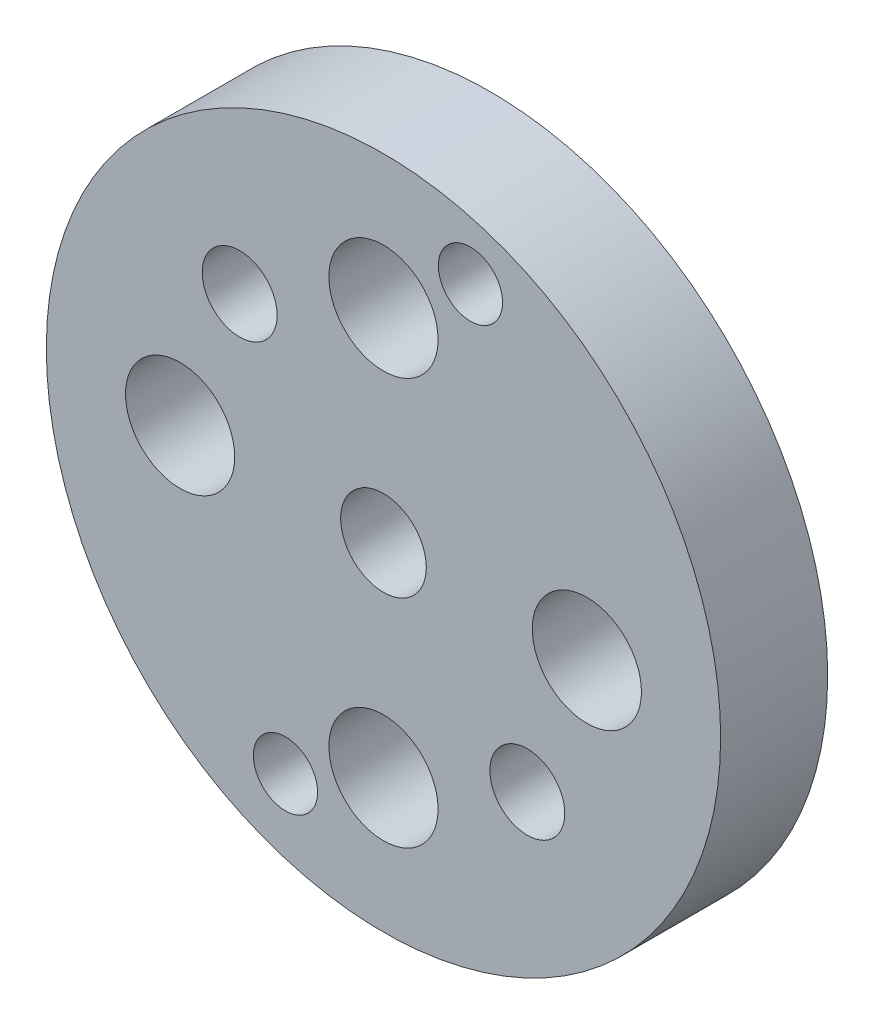
ISO-10303-21;
HEADER;
FILE_DESCRIPTION(('STEP AP214'),'2;1');
FILE_NAME('part.step','',(''),(''),'','','');
FILE_SCHEMA(('AUTOMOTIVE_DESIGN { 1 0 10303 214 1 1 1 1 }'));
ENDSEC;
DATA;
#1=APPLICATION_CONTEXT('core data for automotive mechanical design processes');
#2=APPLICATION_PROTOCOL_DEFINITION('international standard','automotive_design',2000,#1);
#3=PRODUCT_CONTEXT('',#1,'mechanical');
#4=PRODUCT('Part','Part','',(#3));
#5=PRODUCT_RELATED_PRODUCT_CATEGORY('part','',(#4));
#6=PRODUCT_DEFINITION_FORMATION('','',#4);
#7=PRODUCT_DEFINITION_CONTEXT('part definition',#1,'design');
#8=PRODUCT_DEFINITION('design','',#6,#7);
#9=PRODUCT_DEFINITION_SHAPE('','',#8);
#10=(LENGTH_UNIT() NAMED_UNIT(*) SI_UNIT(.MILLI.,.METRE.));
#11=(NAMED_UNIT(*) PLANE_ANGLE_UNIT() SI_UNIT($,.RADIAN.));
#12=(NAMED_UNIT(*) SI_UNIT($,.STERADIAN.) SOLID_ANGLE_UNIT());
#13=UNCERTAINTY_MEASURE_WITH_UNIT(LENGTH_MEASURE(1.E-05),#10,'distance_accuracy_value','');
#14=(GEOMETRIC_REPRESENTATION_CONTEXT(3) GLOBAL_UNCERTAINTY_ASSIGNED_CONTEXT((#13)) GLOBAL_UNIT_ASSIGNED_CONTEXT((#10,
#11,#12)) REPRESENTATION_CONTEXT('',''));
#15=CARTESIAN_POINT('',(0.,0.,0.));
#16=DIRECTION('',(0.,0.,1.));
#17=DIRECTION('',(1.,0.,0.));
#18=AXIS2_PLACEMENT_3D('',#15,#16,#17);
#19=CARTESIAN_POINT('',(19.,0.,10.));
#20=DIRECTION('',(0.,0.,-1.));
#21=DIRECTION('',(-1.,0.,0.));
#22=AXIS2_PLACEMENT_3D('',#19,#20,#21);
#23=CYLINDRICAL_SURFACE('',#22,5.1);
#24=CARTESIAN_POINT('',(19.,0.,2.));
#25=DIRECTION('',(0.,0.,1.));
#26=DIRECTION('',(1.,0.,0.));
#27=AXIS2_PLACEMENT_3D('',#24,#25,#26);
#28=CIRCLE('',#27,5.1);
#29=CARTESIAN_POINT('',(24.1,0.,2.));
#30=VERTEX_POINT('',#29);
#31=EDGE_CURVE('E152',#30,#30,#28,.F.);
#32=ORIENTED_EDGE('',*,*,#31,.T.);
#33=EDGE_LOOP('',(#32));
#34=FACE_BOUND('',#33,.T.);
#35=CARTESIAN_POINT('',(19.,0.,10.));
#36=DIRECTION('',(0.,0.,1.));
#37=DIRECTION('',(1.,0.,0.));
#38=AXIS2_PLACEMENT_3D('',#35,#36,#37);
#39=CIRCLE('',#38,5.1);
#40=CARTESIAN_POINT('',(24.1,0.,10.));
#41=VERTEX_POINT('',#40);
#42=EDGE_CURVE('E81',#41,#41,#39,.F.);
#43=ORIENTED_EDGE('',*,*,#42,.F.);
#44=EDGE_LOOP('',(#43));
#45=FACE_BOUND('',#44,.T.);
#46=ADVANCED_FACE('F39',(#34,#45),#23,.F.);
#47=CARTESIAN_POINT('',(0.,0.,10.));
#48=DIRECTION('',(0.,0.,-1.));
#49=DIRECTION('',(-1.,0.,0.));
#50=AXIS2_PLACEMENT_3D('',#47,#48,#49);
#51=CYLINDRICAL_SURFACE('',#50,31.5);
#52=CARTESIAN_POINT('',(0.,0.,10.));
#53=DIRECTION('',(0.,0.,1.));
#54=DIRECTION('',(1.,0.,0.));
#55=AXIS2_PLACEMENT_3D('',#52,#53,#54);
#56=CIRCLE('',#55,31.5);
#57=CARTESIAN_POINT('',(31.5,0.,10.));
#58=VERTEX_POINT('',#57);
#59=EDGE_CURVE('E85',#58,#58,#56,.T.);
#60=ORIENTED_EDGE('',*,*,#59,.F.);
#61=EDGE_LOOP('',(#60));
#62=FACE_BOUND('',#61,.T.);
#63=CARTESIAN_POINT('',(0.,0.,0.));
#64=DIRECTION('',(0.,0.,1.));
#65=DIRECTION('',(1.,0.,0.));
#66=AXIS2_PLACEMENT_3D('',#63,#64,#65);
#67=CIRCLE('',#66,31.5);
#68=CARTESIAN_POINT('',(31.5,0.,0.));
#69=VERTEX_POINT('',#68);
#70=EDGE_CURVE('E73',#69,#69,#67,.T.);
#71=ORIENTED_EDGE('',*,*,#70,.T.);
#72=EDGE_LOOP('',(#71));
#73=FACE_BOUND('',#72,.T.);
#74=ADVANCED_FACE('F204',(#62,#73),#51,.T.);
#75=CARTESIAN_POINT('',(8.12465383877984,25.,10.));
#76=DIRECTION('',(0.,0.,-1.));
#77=DIRECTION('',(-1.,0.,0.));
#78=AXIS2_PLACEMENT_3D('',#75,#76,#77);
#79=CYLINDRICAL_SURFACE('',#78,3.);
#80=CARTESIAN_POINT('',(8.12465383877984,25.,2.));
#81=DIRECTION('',(0.,0.,1.));
#82=DIRECTION('',(1.,0.,0.));
#83=AXIS2_PLACEMENT_3D('',#80,#81,#82);
#84=CIRCLE('',#83,3.);
#85=CARTESIAN_POINT('',(11.1246538387798,25.,2.));
#86=VERTEX_POINT('',#85);
#87=EDGE_CURVE('E47',#86,#86,#84,.T.);
#88=ORIENTED_EDGE('',*,*,#87,.F.);
#89=EDGE_LOOP('',(#88));
#90=FACE_BOUND('',#89,.T.);
#91=CARTESIAN_POINT('',(8.12465383877984,25.,10.));
#92=DIRECTION('',(0.,0.,1.));
#93=DIRECTION('',(1.,0.,0.));
#94=AXIS2_PLACEMENT_3D('',#91,#92,#93);
#95=CIRCLE('',#94,3.);
#96=CARTESIAN_POINT('',(11.1246538387798,25.,10.));
#97=VERTEX_POINT('',#96);
#98=EDGE_CURVE('E89',#97,#97,#95,.T.);
#99=ORIENTED_EDGE('',*,*,#98,.T.);
#100=EDGE_LOOP('',(#99));
#101=FACE_BOUND('',#100,.T.);
#102=ADVANCED_FACE('F210',(#90,#101),#79,.F.);
#103=CARTESIAN_POINT('',(-9.15629447225261,-23.2628947368421,10.));
#104=DIRECTION('',(0.,0.,-1.));
#105=DIRECTION('',(-1.,0.,0.));
#106=AXIS2_PLACEMENT_3D('',#103,#104,#105);
#107=CYLINDRICAL_SURFACE('',#106,3.00000901800442);
#108=CARTESIAN_POINT('',(-9.15629447225261,-23.2628947368421,2.));
#109=DIRECTION('',(0.,0.,1.));
#110=DIRECTION('',(1.,0.,0.));
#111=AXIS2_PLACEMENT_3D('',#108,#109,#110);
#112=CIRCLE('',#111,3.00000901800442);
#113=CARTESIAN_POINT('',(-6.1562854542482,-23.2628947368421,2.));
#114=VERTEX_POINT('',#113);
#115=EDGE_CURVE('E10',#114,#114,#112,.T.);
#116=ORIENTED_EDGE('',*,*,#115,.F.);
#117=EDGE_LOOP('',(#116));
#118=FACE_BOUND('',#117,.T.);
#119=CARTESIAN_POINT('',(-9.15629447225261,-23.2628947368421,10.));
#120=DIRECTION('',(0.,0.,1.));
#121=DIRECTION('',(1.,0.,0.));
#122=AXIS2_PLACEMENT_3D('',#119,#120,#121);
#123=CIRCLE('',#122,3.00000901800442);
#124=CARTESIAN_POINT('',(-6.1562854542482,-23.2628947368421,10.));
#125=VERTEX_POINT('',#124);
#126=EDGE_CURVE('E93',#125,#125,#123,.T.);
#127=ORIENTED_EDGE('',*,*,#126,.T.);
#128=EDGE_LOOP('',(#127));
#129=FACE_BOUND('',#128,.T.);
#130=ADVANCED_FACE('F220',(#118,#129),#107,.F.);
#131=CARTESIAN_POINT('',(0.,19.,10.));
#132=DIRECTION('',(0.,0.,-1.));
#133=DIRECTION('',(-1.,0.,0.));
#134=AXIS2_PLACEMENT_3D('',#131,#132,#133);
#135=CYLINDRICAL_SURFACE('',#134,5.1);
#136=CARTESIAN_POINT('',(0.,19.,2.));
#137=DIRECTION('',(0.,0.,1.));
#138=DIRECTION('',(1.,0.,0.));
#139=AXIS2_PLACEMENT_3D('',#136,#137,#138);
#140=CIRCLE('',#139,5.1);
#141=CARTESIAN_POINT('',(5.1,19.,2.));
#142=VERTEX_POINT('',#141);
#143=EDGE_CURVE('E52',#142,#142,#140,.T.);
#144=ORIENTED_EDGE('',*,*,#143,.F.);
#145=EDGE_LOOP('',(#144));
#146=FACE_BOUND('',#145,.T.);
#147=CARTESIAN_POINT('',(0.,19.,10.));
#148=DIRECTION('',(0.,0.,1.));
#149=DIRECTION('',(1.,0.,0.));
#150=AXIS2_PLACEMENT_3D('',#147,#148,#149);
#151=CIRCLE('',#150,5.1);
#152=CARTESIAN_POINT('',(5.1,19.,10.));
#153=VERTEX_POINT('',#152);
#154=EDGE_CURVE('E97',#153,#153,#151,.T.);
#155=ORIENTED_EDGE('',*,*,#154,.T.);
#156=EDGE_LOOP('',(#155));
#157=FACE_BOUND('',#156,.T.);
#158=ADVANCED_FACE('F224',(#146,#157),#135,.F.);
#159=CARTESIAN_POINT('',(-13.4365368421053,13.4335206737008,10.));
#160=DIRECTION('',(0.,0.,-1.));
#161=DIRECTION('',(-1.,0.,0.));
#162=AXIS2_PLACEMENT_3D('',#159,#160,#161);
#163=CYLINDRICAL_SURFACE('',#162,3.5);
#164=CARTESIAN_POINT('',(-13.4365368421053,13.4335206737008,2.));
#165=DIRECTION('',(0.,0.,1.));
#166=DIRECTION('',(1.,0.,0.));
#167=AXIS2_PLACEMENT_3D('',#164,#165,#166);
#168=CIRCLE('',#167,3.5);
#169=CARTESIAN_POINT('',(-9.93653684210526,13.4335206737008,2.));
#170=VERTEX_POINT('',#169);
#171=EDGE_CURVE('E57',#170,#170,#168,.T.);
#172=ORIENTED_EDGE('',*,*,#171,.F.);
#173=EDGE_LOOP('',(#172));
#174=FACE_BOUND('',#173,.T.);
#175=CARTESIAN_POINT('',(-13.4365368421053,13.4335206737008,10.));
#176=DIRECTION('',(0.,0.,1.));
#177=DIRECTION('',(1.,0.,0.));
#178=AXIS2_PLACEMENT_3D('',#175,#176,#177);
#179=CIRCLE('',#178,3.5);
#180=CARTESIAN_POINT('',(-9.93653684210526,13.4335206737008,10.));
#181=VERTEX_POINT('',#180);
#182=EDGE_CURVE('E101',#181,#181,#179,.T.);
#183=ORIENTED_EDGE('',*,*,#182,.T.);
#184=EDGE_LOOP('',(#183));
#185=FACE_BOUND('',#184,.T.);
#186=ADVANCED_FACE('F228',(#174,#185),#163,.F.);
#187=CARTESIAN_POINT('',(-19.,0.,10.));
#188=DIRECTION('',(0.,0.,-1.));
#189=DIRECTION('',(-1.,0.,0.));
#190=AXIS2_PLACEMENT_3D('',#187,#188,#189);
#191=CYLINDRICAL_SURFACE('',#190,5.1);
#192=CARTESIAN_POINT('',(-19.,0.,2.));
#193=DIRECTION('',(0.,0.,1.));
#194=DIRECTION('',(1.,0.,0.));
#195=AXIS2_PLACEMENT_3D('',#192,#193,#194);
#196=CIRCLE('',#195,5.1);
#197=CARTESIAN_POINT('',(-13.9,0.,2.));
#198=VERTEX_POINT('',#197);
#199=EDGE_CURVE('E63',#198,#198,#196,.T.);
#200=ORIENTED_EDGE('',*,*,#199,.F.);
#201=EDGE_LOOP('',(#200));
#202=FACE_BOUND('',#201,.T.);
#203=CARTESIAN_POINT('',(-19.,0.,10.));
#204=DIRECTION('',(0.,0.,1.));
#205=DIRECTION('',(1.,0.,0.));
#206=AXIS2_PLACEMENT_3D('',#203,#204,#205);
#207=CIRCLE('',#206,5.1);
#208=CARTESIAN_POINT('',(-13.9,0.,10.));
#209=VERTEX_POINT('',#208);
#210=EDGE_CURVE('E105',#209,#209,#207,.T.);
#211=ORIENTED_EDGE('',*,*,#210,.T.);
#212=EDGE_LOOP('',(#211));
#213=FACE_BOUND('',#212,.T.);
#214=ADVANCED_FACE('F232',(#202,#213),#191,.F.);
#215=CARTESIAN_POINT('',(0.,-19.,10.));
#216=DIRECTION('',(0.,0.,-1.));
#217=DIRECTION('',(-1.,0.,0.));
#218=AXIS2_PLACEMENT_3D('',#215,#216,#217);
#219=CYLINDRICAL_SURFACE('',#218,5.1);
#220=CARTESIAN_POINT('',(0.,-19.,2.));
#221=DIRECTION('',(0.,0.,1.));
#222=DIRECTION('',(1.,0.,0.));
#223=AXIS2_PLACEMENT_3D('',#220,#221,#222);
#224=CIRCLE('',#223,5.1);
#225=CARTESIAN_POINT('',(5.1,-19.,2.));
#226=VERTEX_POINT('',#225);
#227=EDGE_CURVE('E176',#226,#226,#224,.F.);
#228=ORIENTED_EDGE('',*,*,#227,.T.);
#229=EDGE_LOOP('',(#228));
#230=FACE_BOUND('',#229,.T.);
#231=CARTESIAN_POINT('',(0.,-19.,10.));
#232=DIRECTION('',(0.,0.,1.));
#233=DIRECTION('',(1.,0.,0.));
#234=AXIS2_PLACEMENT_3D('',#231,#232,#233);
#235=CIRCLE('',#234,5.1);
#236=CARTESIAN_POINT('',(5.1,-19.,10.));
#237=VERTEX_POINT('',#236);
#238=EDGE_CURVE('E109',#237,#237,#235,.F.);
#239=ORIENTED_EDGE('',*,*,#238,.F.);
#240=EDGE_LOOP('',(#239));
#241=FACE_BOUND('',#240,.T.);
#242=ADVANCED_FACE('F235',(#230,#241),#219,.F.);
#243=CARTESIAN_POINT('',(13.4365368421053,-13.4335206737008,10.));
#244=DIRECTION('',(0.,0.,-1.));
#245=DIRECTION('',(-1.,0.,0.));
#246=AXIS2_PLACEMENT_3D('',#243,#244,#245);
#247=CYLINDRICAL_SURFACE('',#246,3.5);
#248=CARTESIAN_POINT('',(13.4365368421053,-13.4335206737008,2.));
#249=DIRECTION('',(0.,0.,1.));
#250=DIRECTION('',(1.,0.,0.));
#251=AXIS2_PLACEMENT_3D('',#248,#249,#250);
#252=CIRCLE('',#251,3.5);
#253=CARTESIAN_POINT('',(16.9365368421053,-13.4335206737008,2.));
#254=VERTEX_POINT('',#253);
#255=EDGE_CURVE('E153',#254,#254,#252,.F.);
#256=ORIENTED_EDGE('',*,*,#255,.T.);
#257=EDGE_LOOP('',(#256));
#258=FACE_BOUND('',#257,.T.);
#259=CARTESIAN_POINT('',(13.4365368421053,-13.4335206737008,10.));
#260=DIRECTION('',(0.,0.,1.));
#261=DIRECTION('',(1.,0.,0.));
#262=AXIS2_PLACEMENT_3D('',#259,#260,#261);
#263=CIRCLE('',#262,3.5);
#264=CARTESIAN_POINT('',(16.9365368421053,-13.4335206737008,10.));
#265=VERTEX_POINT('',#264);
#266=EDGE_CURVE('E72',#265,#265,#263,.F.);
#267=ORIENTED_EDGE('',*,*,#266,.F.);
#268=EDGE_LOOP('',(#267));
#269=FACE_BOUND('',#268,.T.);
#270=ADVANCED_FACE('F41',(#258,#269),#247,.F.);
#271=CARTESIAN_POINT('',(0.,0.,10.));
#272=DIRECTION('',(0.,0.,-1.));
#273=DIRECTION('',(-1.,0.,0.));
#274=AXIS2_PLACEMENT_3D('',#271,#272,#273);
#275=CYLINDRICAL_SURFACE('',#274,4.);
#276=CARTESIAN_POINT('',(0.,0.,10.));
#277=DIRECTION('',(0.,0.,1.));
#278=DIRECTION('',(1.,0.,0.));
#279=AXIS2_PLACEMENT_3D('',#276,#277,#278);
#280=CIRCLE('',#279,4.);
#281=CARTESIAN_POINT('',(4.,0.,10.));
#282=VERTEX_POINT('',#281);
#283=EDGE_CURVE('E67',#282,#282,#280,.T.);
#284=ORIENTED_EDGE('',*,*,#283,.T.);
#285=EDGE_LOOP('',(#284));
#286=FACE_BOUND('',#285,.T.);
#287=CARTESIAN_POINT('',(0.,0.,0.));
#288=DIRECTION('',(0.,0.,1.));
#289=DIRECTION('',(1.,0.,0.));
#290=AXIS2_PLACEMENT_3D('',#287,#288,#289);
#291=CIRCLE('',#290,4.);
#292=CARTESIAN_POINT('',(4.,0.,0.));
#293=VERTEX_POINT('',#292);
#294=EDGE_CURVE('E68',#293,#293,#291,.T.);
#295=ORIENTED_EDGE('',*,*,#294,.F.);
#296=EDGE_LOOP('',(#295));
#297=FACE_BOUND('',#296,.T.);
#298=ADVANCED_FACE('F215',(#286,#297),#275,.F.);
#299=CARTESIAN_POINT('',(0.,0.,10.));
#300=DIRECTION('',(0.,0.,1.));
#301=DIRECTION('',(1.,0.,0.));
#302=AXIS2_PLACEMENT_3D('',#299,#300,#301);
#303=PLANE('',#302);
#304=ORIENTED_EDGE('',*,*,#266,.T.);
#305=EDGE_LOOP('',(#304));
#306=FACE_BOUND('',#305,.T.);
#307=ORIENTED_EDGE('',*,*,#238,.T.);
#308=EDGE_LOOP('',(#307));
#309=FACE_BOUND('',#308,.T.);
#310=ORIENTED_EDGE('',*,*,#210,.F.);
#311=EDGE_LOOP('',(#310));
#312=FACE_BOUND('',#311,.T.);
#313=ORIENTED_EDGE('',*,*,#182,.F.);
#314=EDGE_LOOP('',(#313));
#315=FACE_BOUND('',#314,.T.);
#316=ORIENTED_EDGE('',*,*,#154,.F.);
#317=EDGE_LOOP('',(#316));
#318=FACE_BOUND('',#317,.T.);
#319=ORIENTED_EDGE('',*,*,#126,.F.);
#320=EDGE_LOOP('',(#319));
#321=FACE_BOUND('',#320,.T.);
#322=ORIENTED_EDGE('',*,*,#98,.F.);
#323=EDGE_LOOP('',(#322));
#324=FACE_BOUND('',#323,.T.);
#325=ORIENTED_EDGE('',*,*,#59,.T.);
#326=EDGE_LOOP('',(#325));
#327=FACE_BOUND('',#326,.T.);
#328=ORIENTED_EDGE('',*,*,#42,.T.);
#329=EDGE_LOOP('',(#328));
#330=FACE_BOUND('',#329,.T.);
#331=ORIENTED_EDGE('',*,*,#283,.F.);
#332=EDGE_LOOP('',(#331));
#333=FACE_BOUND('',#332,.T.);
#334=ADVANCED_FACE('F247',(#306,#309,#312,#315,#318,#321,#324,#327,#330,#333),#303,.T.);
#335=CARTESIAN_POINT('',(0.,0.,0.));
#336=DIRECTION('',(0.,0.,1.));
#337=DIRECTION('',(1.,0.,0.));
#338=AXIS2_PLACEMENT_3D('',#335,#336,#337);
#339=PLANE('',#338);
#340=ORIENTED_EDGE('',*,*,#70,.F.);
#341=EDGE_LOOP('',(#340));
#342=FACE_BOUND('',#341,.T.);
#343=ORIENTED_EDGE('',*,*,#294,.T.);
#344=EDGE_LOOP('',(#343));
#345=FACE_BOUND('',#344,.T.);
#346=CARTESIAN_POINT('',(-19.,0.,0.));
#347=DIRECTION('',(0.,0.,1.));
#348=DIRECTION('',(1.,0.,0.));
#349=AXIS2_PLACEMENT_3D('',#346,#347,#348);
#350=CIRCLE('',#349,3.5);
#351=CARTESIAN_POINT('',(-15.5,0.,0.));
#352=VERTEX_POINT('',#351);
#353=EDGE_CURVE('E116',#352,#352,#350,.T.);
#354=ORIENTED_EDGE('',*,*,#353,.T.);
#355=EDGE_LOOP('',(#354));
#356=FACE_BOUND('',#355,.T.);
#357=CARTESIAN_POINT('',(-13.4365368421053,13.4335206737008,0.));
#358=DIRECTION('',(0.,0.,1.));
#359=DIRECTION('',(1.,0.,0.));
#360=AXIS2_PLACEMENT_3D('',#357,#358,#359);
#361=CIRCLE('',#360,3.);
#362=CARTESIAN_POINT('',(-10.4365368421053,13.4335206737008,0.));
#363=VERTEX_POINT('',#362);
#364=EDGE_CURVE('E124',#363,#363,#361,.T.);
#365=ORIENTED_EDGE('',*,*,#364,.T.);
#366=EDGE_LOOP('',(#365));
#367=FACE_BOUND('',#366,.T.);
#368=CARTESIAN_POINT('',(0.,19.,0.));
#369=DIRECTION('',(0.,0.,1.));
#370=DIRECTION('',(1.,0.,0.));
#371=AXIS2_PLACEMENT_3D('',#368,#369,#370);
#372=CIRCLE('',#371,3.5);
#373=CARTESIAN_POINT('',(3.5,19.,0.));
#374=VERTEX_POINT('',#373);
#375=EDGE_CURVE('E132',#374,#374,#372,.T.);
#376=ORIENTED_EDGE('',*,*,#375,.T.);
#377=EDGE_LOOP('',(#376));
#378=FACE_BOUND('',#377,.T.);
#379=CARTESIAN_POINT('',(8.12465383877984,25.,0.));
#380=DIRECTION('',(0.,0.,1.));
#381=DIRECTION('',(1.,0.,0.));
#382=AXIS2_PLACEMENT_3D('',#379,#380,#381);
#383=CIRCLE('',#382,2.5);
#384=CARTESIAN_POINT('',(10.6246538387798,25.,0.));
#385=VERTEX_POINT('',#384);
#386=EDGE_CURVE('E140',#385,#385,#383,.T.);
#387=ORIENTED_EDGE('',*,*,#386,.T.);
#388=EDGE_LOOP('',(#387));
#389=FACE_BOUND('',#388,.T.);
#390=CARTESIAN_POINT('',(19.,0.,0.));
#391=DIRECTION('',(0.,0.,1.));
#392=DIRECTION('',(1.,0.,0.));
#393=AXIS2_PLACEMENT_3D('',#390,#391,#392);
#394=CIRCLE('',#393,3.5);
#395=CARTESIAN_POINT('',(22.5,0.,0.));
#396=VERTEX_POINT('',#395);
#397=EDGE_CURVE('E148',#396,#396,#394,.F.);
#398=ORIENTED_EDGE('',*,*,#397,.F.);
#399=EDGE_LOOP('',(#398));
#400=FACE_BOUND('',#399,.T.);
#401=CARTESIAN_POINT('',(13.4365368421053,-13.4335206737008,0.));
#402=DIRECTION('',(0.,0.,1.));
#403=DIRECTION('',(1.,0.,0.));
#404=AXIS2_PLACEMENT_3D('',#401,#402,#403);
#405=CIRCLE('',#404,3.);
#406=CARTESIAN_POINT('',(16.4365368421053,-13.4335206737008,0.));
#407=VERTEX_POINT('',#406);
#408=EDGE_CURVE('E160',#407,#407,#405,.T.);
#409=ORIENTED_EDGE('',*,*,#408,.T.);
#410=EDGE_LOOP('',(#409));
#411=FACE_BOUND('',#410,.T.);
#412=CARTESIAN_POINT('',(0.,-19.,0.));
#413=DIRECTION('',(0.,0.,1.));
#414=DIRECTION('',(1.,0.,0.));
#415=AXIS2_PLACEMENT_3D('',#412,#413,#414);
#416=CIRCLE('',#415,3.5);
#417=CARTESIAN_POINT('',(3.5,-19.,0.));
#418=VERTEX_POINT('',#417);
#419=EDGE_CURVE('E172',#418,#418,#416,.F.);
#420=ORIENTED_EDGE('',*,*,#419,.F.);
#421=EDGE_LOOP('',(#420));
#422=FACE_BOUND('',#421,.T.);
#423=CARTESIAN_POINT('',(-9.15629447225261,-23.2628947368421,0.));
#424=DIRECTION('',(0.,0.,1.));
#425=DIRECTION('',(1.,0.,0.));
#426=AXIS2_PLACEMENT_3D('',#423,#424,#425);
#427=CIRCLE('',#426,2.5);
#428=CARTESIAN_POINT('',(-6.65629447225261,-23.2628947368421,0.));
#429=VERTEX_POINT('',#428);
#430=EDGE_CURVE('E184',#429,#429,#427,.T.);
#431=ORIENTED_EDGE('',*,*,#430,.T.);
#432=EDGE_LOOP('',(#431));
#433=FACE_BOUND('',#432,.T.);
#434=ADVANCED_FACE('F250',(#342,#345,#356,#367,#378,#389,#400,#411,#422,#433),#339,.F.);
#435=CARTESIAN_POINT('',(-19.,0.,2.));
#436=DIRECTION('',(0.,0.,-1.));
#437=DIRECTION('',(-1.,0.,0.));
#438=AXIS2_PLACEMENT_3D('',#435,#436,#437);
#439=CYLINDRICAL_SURFACE('',#438,3.5);
#440=CARTESIAN_POINT('',(-19.,0.,2.));
#441=DIRECTION('',(0.,0.,1.));
#442=DIRECTION('',(1.,0.,0.));
#443=AXIS2_PLACEMENT_3D('',#440,#441,#442);
#444=CIRCLE('',#443,3.5);
#445=CARTESIAN_POINT('',(-15.5,0.,2.));
#446=VERTEX_POINT('',#445);
#447=EDGE_CURVE('E77',#446,#446,#444,.T.);
#448=ORIENTED_EDGE('',*,*,#447,.T.);
#449=EDGE_LOOP('',(#448));
#450=FACE_BOUND('',#449,.T.);
#451=ORIENTED_EDGE('',*,*,#353,.F.);
#452=EDGE_LOOP('',(#451));
#453=FACE_BOUND('',#452,.T.);
#454=ADVANCED_FACE('F275',(#450,#453),#439,.F.);
#455=CARTESIAN_POINT('',(0.,0.,2.));
#456=DIRECTION('',(0.,0.,1.));
#457=DIRECTION('',(1.,0.,0.));
#458=AXIS2_PLACEMENT_3D('',#455,#456,#457);
#459=PLANE('',#458);
#460=ORIENTED_EDGE('',*,*,#447,.F.);
#461=EDGE_LOOP('',(#460));
#462=FACE_BOUND('',#461,.T.);
#463=ORIENTED_EDGE('',*,*,#199,.T.);
#464=EDGE_LOOP('',(#463));
#465=FACE_BOUND('',#464,.T.);
#466=ADVANCED_FACE('F343',(#462,#465),#459,.T.);
#467=CARTESIAN_POINT('',(-13.4365368421053,13.4335206737008,2.));
#468=DIRECTION('',(0.,0.,-1.));
#469=DIRECTION('',(-1.,0.,0.));
#470=AXIS2_PLACEMENT_3D('',#467,#468,#469);
#471=CYLINDRICAL_SURFACE('',#470,3.);
#472=CARTESIAN_POINT('',(-13.4365368421053,13.4335206737008,2.));
#473=DIRECTION('',(0.,0.,1.));
#474=DIRECTION('',(1.,0.,0.));
#475=AXIS2_PLACEMENT_3D('',#472,#473,#474);
#476=CIRCLE('',#475,3.);
#477=CARTESIAN_POINT('',(-10.4365368421053,13.4335206737008,2.));
#478=VERTEX_POINT('',#477);
#479=EDGE_CURVE('E120',#478,#478,#476,.T.);
#480=ORIENTED_EDGE('',*,*,#479,.T.);
#481=EDGE_LOOP('',(#480));
#482=FACE_BOUND('',#481,.T.);
#483=ORIENTED_EDGE('',*,*,#364,.F.);
#484=EDGE_LOOP('',(#483));
#485=FACE_BOUND('',#484,.T.);
#486=ADVANCED_FACE('F339',(#482,#485),#471,.F.);
#487=CARTESIAN_POINT('',(0.,0.,2.));
#488=DIRECTION('',(0.,0.,1.));
#489=DIRECTION('',(1.,0.,0.));
#490=AXIS2_PLACEMENT_3D('',#487,#488,#489);
#491=PLANE('',#490);
#492=ORIENTED_EDGE('',*,*,#171,.T.);
#493=EDGE_LOOP('',(#492));
#494=FACE_BOUND('',#493,.T.);
#495=ORIENTED_EDGE('',*,*,#479,.F.);
#496=EDGE_LOOP('',(#495));
#497=FACE_BOUND('',#496,.T.);
#498=ADVANCED_FACE('F335',(#494,#497),#491,.T.);
#499=CARTESIAN_POINT('',(0.,19.,2.));
#500=DIRECTION('',(0.,0.,-1.));
#501=DIRECTION('',(-1.,0.,0.));
#502=AXIS2_PLACEMENT_3D('',#499,#500,#501);
#503=CYLINDRICAL_SURFACE('',#502,3.5);
#504=CARTESIAN_POINT('',(0.,19.,2.));
#505=DIRECTION('',(0.,0.,1.));
#506=DIRECTION('',(1.,0.,0.));
#507=AXIS2_PLACEMENT_3D('',#504,#505,#506);
#508=CIRCLE('',#507,3.5);
#509=CARTESIAN_POINT('',(3.5,19.,2.));
#510=VERTEX_POINT('',#509);
#511=EDGE_CURVE('E128',#510,#510,#508,.T.);
#512=ORIENTED_EDGE('',*,*,#511,.T.);
#513=EDGE_LOOP('',(#512));
#514=FACE_BOUND('',#513,.T.);
#515=ORIENTED_EDGE('',*,*,#375,.F.);
#516=EDGE_LOOP('',(#515));
#517=FACE_BOUND('',#516,.T.);
#518=ADVANCED_FACE('F331',(#514,#517),#503,.F.);
#519=CARTESIAN_POINT('',(0.,0.,2.));
#520=DIRECTION('',(0.,0.,1.));
#521=DIRECTION('',(1.,0.,0.));
#522=AXIS2_PLACEMENT_3D('',#519,#520,#521);
#523=PLANE('',#522);
#524=ORIENTED_EDGE('',*,*,#143,.T.);
#525=EDGE_LOOP('',(#524));
#526=FACE_BOUND('',#525,.T.);
#527=ORIENTED_EDGE('',*,*,#511,.F.);
#528=EDGE_LOOP('',(#527));
#529=FACE_BOUND('',#528,.T.);
#530=ADVANCED_FACE('F327',(#526,#529),#523,.T.);
#531=CARTESIAN_POINT('',(8.12465383877984,25.,2.));
#532=DIRECTION('',(0.,0.,-1.));
#533=DIRECTION('',(-1.,0.,0.));
#534=AXIS2_PLACEMENT_3D('',#531,#532,#533);
#535=CYLINDRICAL_SURFACE('',#534,2.5);
#536=CARTESIAN_POINT('',(8.12465383877984,25.,2.));
#537=DIRECTION('',(0.,0.,1.));
#538=DIRECTION('',(1.,0.,0.));
#539=AXIS2_PLACEMENT_3D('',#536,#537,#538);
#540=CIRCLE('',#539,2.5);
#541=CARTESIAN_POINT('',(10.6246538387798,25.,2.));
#542=VERTEX_POINT('',#541);
#543=EDGE_CURVE('E136',#542,#542,#540,.T.);
#544=ORIENTED_EDGE('',*,*,#543,.T.);
#545=EDGE_LOOP('',(#544));
#546=FACE_BOUND('',#545,.T.);
#547=ORIENTED_EDGE('',*,*,#386,.F.);
#548=EDGE_LOOP('',(#547));
#549=FACE_BOUND('',#548,.T.);
#550=ADVANCED_FACE('F323',(#546,#549),#535,.F.);
#551=CARTESIAN_POINT('',(0.,0.,2.));
#552=DIRECTION('',(0.,0.,1.));
#553=DIRECTION('',(1.,0.,0.));
#554=AXIS2_PLACEMENT_3D('',#551,#552,#553);
#555=PLANE('',#554);
#556=ORIENTED_EDGE('',*,*,#543,.F.);
#557=EDGE_LOOP('',(#556));
#558=FACE_BOUND('',#557,.T.);
#559=ORIENTED_EDGE('',*,*,#87,.T.);
#560=EDGE_LOOP('',(#559));
#561=FACE_BOUND('',#560,.T.);
#562=ADVANCED_FACE('F319',(#558,#561),#555,.T.);
#563=CARTESIAN_POINT('',(19.,0.,2.));
#564=DIRECTION('',(0.,0.,-1.));
#565=DIRECTION('',(-1.,0.,0.));
#566=AXIS2_PLACEMENT_3D('',#563,#564,#565);
#567=CYLINDRICAL_SURFACE('',#566,3.5);
#568=CARTESIAN_POINT('',(19.,0.,2.));
#569=DIRECTION('',(0.,0.,1.));
#570=DIRECTION('',(1.,0.,0.));
#571=AXIS2_PLACEMENT_3D('',#568,#569,#570);
#572=CIRCLE('',#571,3.5);
#573=CARTESIAN_POINT('',(22.5,0.,2.));
#574=VERTEX_POINT('',#573);
#575=EDGE_CURVE('E144',#574,#574,#572,.F.);
#576=ORIENTED_EDGE('',*,*,#575,.F.);
#577=EDGE_LOOP('',(#576));
#578=FACE_BOUND('',#577,.T.);
#579=ORIENTED_EDGE('',*,*,#397,.T.);
#580=EDGE_LOOP('',(#579));
#581=FACE_BOUND('',#580,.T.);
#582=ADVANCED_FACE('F315',(#578,#581),#567,.F.);
#583=CARTESIAN_POINT('',(0.,0.,2.));
#584=DIRECTION('',(0.,0.,1.));
#585=DIRECTION('',(1.,0.,0.));
#586=AXIS2_PLACEMENT_3D('',#583,#584,#585);
#587=PLANE('',#586);
#588=ORIENTED_EDGE('',*,*,#31,.F.);
#589=EDGE_LOOP('',(#588));
#590=FACE_BOUND('',#589,.T.);
#591=ORIENTED_EDGE('',*,*,#575,.T.);
#592=EDGE_LOOP('',(#591));
#593=FACE_BOUND('',#592,.T.);
#594=ADVANCED_FACE('F311',(#590,#593),#587,.T.);
#595=CARTESIAN_POINT('',(13.4365368421053,-13.4335206737008,2.));
#596=DIRECTION('',(0.,0.,-1.));
#597=DIRECTION('',(-1.,0.,0.));
#598=AXIS2_PLACEMENT_3D('',#595,#596,#597);
#599=CYLINDRICAL_SURFACE('',#598,3.);
#600=CARTESIAN_POINT('',(13.4365368421053,-13.4335206737008,2.));
#601=DIRECTION('',(0.,0.,1.));
#602=DIRECTION('',(1.,0.,0.));
#603=AXIS2_PLACEMENT_3D('',#600,#601,#602);
#604=CIRCLE('',#603,3.);
#605=CARTESIAN_POINT('',(16.4365368421053,-13.4335206737008,2.));
#606=VERTEX_POINT('',#605);
#607=EDGE_CURVE('E164',#606,#606,#604,.T.);
#608=ORIENTED_EDGE('',*,*,#607,.T.);
#609=EDGE_LOOP('',(#608));
#610=FACE_BOUND('',#609,.T.);
#611=ORIENTED_EDGE('',*,*,#408,.F.);
#612=EDGE_LOOP('',(#611));
#613=FACE_BOUND('',#612,.T.);
#614=ADVANCED_FACE('F304',(#610,#613),#599,.F.);
#615=CARTESIAN_POINT('',(0.,0.,2.));
#616=DIRECTION('',(0.,0.,1.));
#617=DIRECTION('',(1.,0.,0.));
#618=AXIS2_PLACEMENT_3D('',#615,#616,#617);
#619=PLANE('',#618);
#620=ORIENTED_EDGE('',*,*,#607,.F.);
#621=EDGE_LOOP('',(#620));
#622=FACE_BOUND('',#621,.T.);
#623=ORIENTED_EDGE('',*,*,#255,.F.);
#624=EDGE_LOOP('',(#623));
#625=FACE_BOUND('',#624,.T.);
#626=ADVANCED_FACE('F295',(#622,#625),#619,.T.);
#627=CARTESIAN_POINT('',(0.,-19.,2.));
#628=DIRECTION('',(0.,0.,-1.));
#629=DIRECTION('',(-1.,0.,0.));
#630=AXIS2_PLACEMENT_3D('',#627,#628,#629);
#631=CYLINDRICAL_SURFACE('',#630,3.5);
#632=CARTESIAN_POINT('',(0.,-19.,2.));
#633=DIRECTION('',(0.,0.,1.));
#634=DIRECTION('',(1.,0.,0.));
#635=AXIS2_PLACEMENT_3D('',#632,#633,#634);
#636=CIRCLE('',#635,3.5);
#637=CARTESIAN_POINT('',(3.5,-19.,2.));
#638=VERTEX_POINT('',#637);
#639=EDGE_CURVE('E165',#638,#638,#636,.F.);
#640=ORIENTED_EDGE('',*,*,#639,.F.);
#641=EDGE_LOOP('',(#640));
#642=FACE_BOUND('',#641,.T.);
#643=ORIENTED_EDGE('',*,*,#419,.T.);
#644=EDGE_LOOP('',(#643));
#645=FACE_BOUND('',#644,.T.);
#646=ADVANCED_FACE('F293',(#642,#645),#631,.F.);
#647=CARTESIAN_POINT('',(0.,0.,2.));
#648=DIRECTION('',(0.,0.,1.));
#649=DIRECTION('',(1.,0.,0.));
#650=AXIS2_PLACEMENT_3D('',#647,#648,#649);
#651=PLANE('',#650);
#652=ORIENTED_EDGE('',*,*,#227,.F.);
#653=EDGE_LOOP('',(#652));
#654=FACE_BOUND('',#653,.T.);
#655=ORIENTED_EDGE('',*,*,#639,.T.);
#656=EDGE_LOOP('',(#655));
#657=FACE_BOUND('',#656,.T.);
#658=ADVANCED_FACE('F201',(#654,#657),#651,.T.);
#659=CARTESIAN_POINT('',(-9.15629447225261,-23.2628947368421,2.));
#660=DIRECTION('',(0.,0.,-1.));
#661=DIRECTION('',(-1.,0.,0.));
#662=AXIS2_PLACEMENT_3D('',#659,#660,#661);
#663=CYLINDRICAL_SURFACE('',#662,2.5);
#664=CARTESIAN_POINT('',(-9.15629447225261,-23.2628947368421,2.));
#665=DIRECTION('',(0.,0.,1.));
#666=DIRECTION('',(1.,0.,0.));
#667=AXIS2_PLACEMENT_3D('',#664,#665,#666);
#668=CIRCLE('',#667,2.5);
#669=CARTESIAN_POINT('',(-6.65629447225261,-23.2628947368421,2.));
#670=VERTEX_POINT('',#669);
#671=EDGE_CURVE('E177',#670,#670,#668,.T.);
#672=ORIENTED_EDGE('',*,*,#671,.T.);
#673=EDGE_LOOP('',(#672));
#674=FACE_BOUND('',#673,.T.);
#675=ORIENTED_EDGE('',*,*,#430,.F.);
#676=EDGE_LOOP('',(#675));
#677=FACE_BOUND('',#676,.T.);
#678=ADVANCED_FACE('F192',(#674,#677),#663,.F.);
#679=CARTESIAN_POINT('',(0.,0.,2.));
#680=DIRECTION('',(0.,0.,1.));
#681=DIRECTION('',(1.,0.,0.));
#682=AXIS2_PLACEMENT_3D('',#679,#680,#681);
#683=PLANE('',#682);
#684=ORIENTED_EDGE('',*,*,#671,.F.);
#685=EDGE_LOOP('',(#684));
#686=FACE_BOUND('',#685,.T.);
#687=ORIENTED_EDGE('',*,*,#115,.T.);
#688=EDGE_LOOP('',(#687));
#689=FACE_BOUND('',#688,.T.);
#690=ADVANCED_FACE('F195',(#686,#689),#683,.T.);
#691=CLOSED_SHELL('',(#46,#74,#102,#130,#158,#186,#214,#242,#270,#298,#334,#434,#454,#466,#486,
#498,#518,#530,#550,#562,#582,#594,#614,#626,#646,#658,#678,#690));
#692=MANIFOLD_SOLID_BREP('B2',#691);
#693=ADVANCED_BREP_SHAPE_REPRESENTATION('',(#18,#692),#14);
#694=SHAPE_DEFINITION_REPRESENTATION(#9,#693);
ENDSEC;
END-ISO-10303-21;
